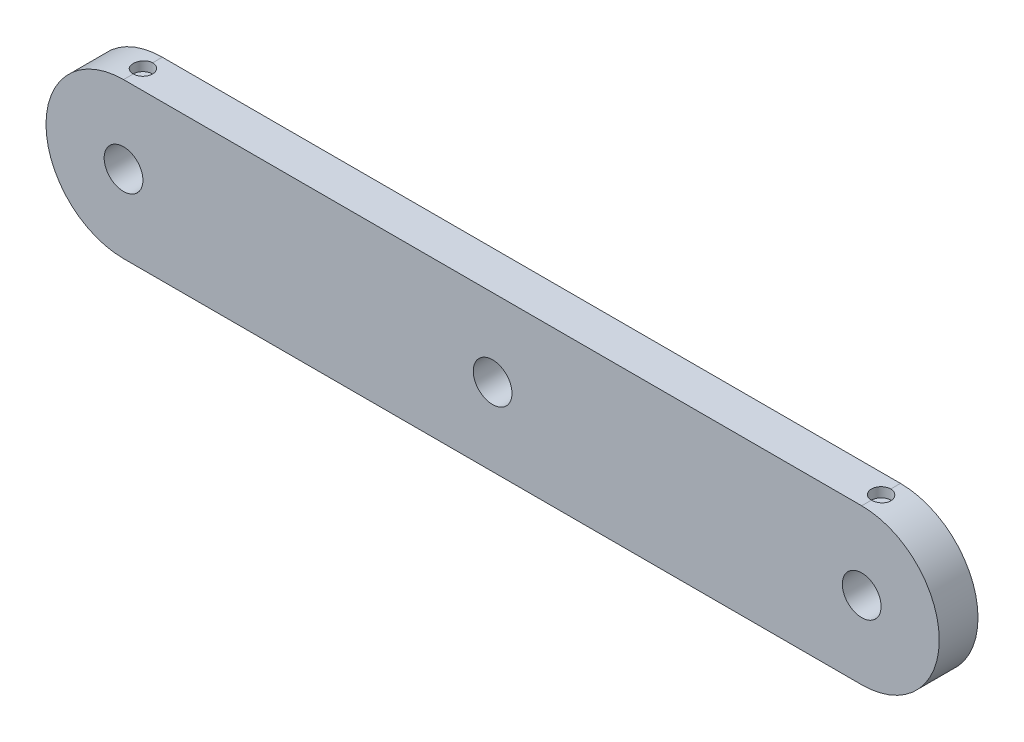
ISO-10303-21;
HEADER;
FILE_DESCRIPTION(('STEP AP214'),'2;1');
FILE_NAME('part.step','',(''),(''),'','','');
FILE_SCHEMA(('AUTOMOTIVE_DESIGN { 1 0 10303 214 1 1 1 1 }'));
ENDSEC;
DATA;
#1=APPLICATION_CONTEXT('core data for automotive mechanical design processes');
#2=APPLICATION_PROTOCOL_DEFINITION('international standard','automotive_design',2000,#1);
#3=PRODUCT_CONTEXT('',#1,'mechanical');
#4=PRODUCT('Part','Part','',(#3));
#5=PRODUCT_RELATED_PRODUCT_CATEGORY('part','',(#4));
#6=PRODUCT_DEFINITION_FORMATION('','',#4);
#7=PRODUCT_DEFINITION_CONTEXT('part definition',#1,'design');
#8=PRODUCT_DEFINITION('design','',#6,#7);
#9=PRODUCT_DEFINITION_SHAPE('','',#8);
#10=(LENGTH_UNIT() NAMED_UNIT(*) SI_UNIT(.MILLI.,.METRE.));
#11=(NAMED_UNIT(*) PLANE_ANGLE_UNIT() SI_UNIT($,.RADIAN.));
#12=(NAMED_UNIT(*) SI_UNIT($,.STERADIAN.) SOLID_ANGLE_UNIT());
#13=UNCERTAINTY_MEASURE_WITH_UNIT(LENGTH_MEASURE(1.E-05),#10,'distance_accuracy_value','');
#14=(GEOMETRIC_REPRESENTATION_CONTEXT(3) GLOBAL_UNCERTAINTY_ASSIGNED_CONTEXT((#13)) GLOBAL_UNIT_ASSIGNED_CONTEXT((#10,
#11,#12)) REPRESENTATION_CONTEXT('',''));
#15=CARTESIAN_POINT('',(0.,0.,0.));
#16=DIRECTION('',(0.,0.,1.));
#17=DIRECTION('',(1.,0.,0.));
#18=AXIS2_PLACEMENT_3D('',#15,#16,#17);
#19=CARTESIAN_POINT('',(-19.0419865714244,0.,2.));
#20=DIRECTION('',(0.,0.,1.));
#21=DIRECTION('',(1.,0.,0.));
#22=AXIS2_PLACEMENT_3D('',#19,#20,#21);
#23=PLANE('',#22);
#24=CARTESIAN_POINT('',(-19.0419865714244,0.,2.));
#25=DIRECTION('',(0.,0.,1.));
#26=DIRECTION('',(1.,0.,0.));
#27=AXIS2_PLACEMENT_3D('',#24,#25,#26);
#28=CIRCLE('',#27,0.999999999999943);
#29=CARTESIAN_POINT('',(-18.0419865714244,0.,2.));
#30=VERTEX_POINT('',#29);
#31=EDGE_CURVE('E134',#30,#30,#28,.T.);
#32=ORIENTED_EDGE('',*,*,#31,.F.);
#33=EDGE_LOOP('',(#32));
#34=FACE_BOUND('',#33,.T.);
#35=CARTESIAN_POINT('',(-19.0419865714244,0.,2.));
#36=DIRECTION('',(0.,0.,1.));
#37=DIRECTION('',(1.,0.,0.));
#38=AXIS2_PLACEMENT_3D('',#35,#36,#37);
#39=CIRCLE('',#38,3.99999999999989);
#40=CARTESIAN_POINT('',(-19.0419865714246,3.99999999999995,2.));
#41=VERTEX_POINT('',#40);
#42=CARTESIAN_POINT('',(-19.0419865714244,-3.99999999999984,2.));
#43=VERTEX_POINT('',#42);
#44=EDGE_CURVE('E115',#41,#43,#39,.T.);
#45=ORIENTED_EDGE('',*,*,#44,.T.);
#46=DIRECTION('',(1.,0.,0.));
#47=VECTOR('',#46,1.);
#48=CARTESIAN_POINT('',(-19.0419865714244,-3.99999999999984,2.));
#49=LINE('',#48,#47);
#50=CARTESIAN_POINT('',(19.0419865714246,-3.99999999999995,2.));
#51=VERTEX_POINT('',#50);
#52=EDGE_CURVE('E127',#43,#51,#49,.T.);
#53=ORIENTED_EDGE('',*,*,#52,.T.);
#54=CARTESIAN_POINT('',(19.0419865714246,0.,2.));
#55=DIRECTION('',(0.,0.,1.));
#56=DIRECTION('',(1.,0.,0.));
#57=AXIS2_PLACEMENT_3D('',#54,#55,#56);
#58=CIRCLE('',#57,3.99999999999989);
#59=CARTESIAN_POINT('',(19.0419865714246,3.99999999999995,2.));
#60=VERTEX_POINT('',#59);
#61=EDGE_CURVE('E125',#51,#60,#58,.T.);
#62=ORIENTED_EDGE('',*,*,#61,.T.);
#63=DIRECTION('',(-1.,0.,0.));
#64=VECTOR('',#63,1.);
#65=CARTESIAN_POINT('',(-19.0419865714246,3.99999999999995,2.));
#66=LINE('',#65,#64);
#67=EDGE_CURVE('E104',#60,#41,#66,.T.);
#68=ORIENTED_EDGE('',*,*,#67,.T.);
#69=EDGE_LOOP('',(#45,#53,#62,#68));
#70=FACE_BOUND('',#69,.T.);
#71=CARTESIAN_POINT('',(0.,0.,2.));
#72=DIRECTION('',(0.,0.,1.));
#73=DIRECTION('',(1.,0.,0.));
#74=AXIS2_PLACEMENT_3D('',#71,#72,#73);
#75=CIRCLE('',#74,1.00000000000007);
#76=CARTESIAN_POINT('',(1.00000000000007,0.,2.));
#77=VERTEX_POINT('',#76);
#78=EDGE_CURVE('E123',#77,#77,#75,.T.);
#79=ORIENTED_EDGE('',*,*,#78,.F.);
#80=EDGE_LOOP('',(#79));
#81=FACE_BOUND('',#80,.T.);
#82=CARTESIAN_POINT('',(19.0419865714246,0.,2.));
#83=DIRECTION('',(0.,0.,1.));
#84=DIRECTION('',(1.,0.,0.));
#85=AXIS2_PLACEMENT_3D('',#82,#83,#84);
#86=CIRCLE('',#85,1.00000000000007);
#87=CARTESIAN_POINT('',(20.0419865714247,0.,2.));
#88=VERTEX_POINT('',#87);
#89=EDGE_CURVE('E140',#88,#88,#86,.T.);
#90=ORIENTED_EDGE('',*,*,#89,.F.);
#91=EDGE_LOOP('',(#90));
#92=FACE_BOUND('',#91,.T.);
#93=ADVANCED_FACE('F33',(#34,#70,#81,#92),#23,.T.);
#94=CARTESIAN_POINT('',(-19.0419865714244,0.,0.));
#95=DIRECTION('',(0.,0.,1.));
#96=DIRECTION('',(1.,0.,0.));
#97=AXIS2_PLACEMENT_3D('',#94,#95,#96);
#98=PLANE('',#97);
#99=CARTESIAN_POINT('',(-19.0419865714244,0.,0.));
#100=DIRECTION('',(0.,0.,1.));
#101=DIRECTION('',(1.,0.,0.));
#102=AXIS2_PLACEMENT_3D('',#99,#100,#101);
#103=CIRCLE('',#102,0.999999999999943);
#104=CARTESIAN_POINT('',(-18.0419865714244,0.,0.));
#105=VERTEX_POINT('',#104);
#106=EDGE_CURVE('E137',#105,#105,#103,.T.);
#107=ORIENTED_EDGE('',*,*,#106,.T.);
#108=EDGE_LOOP('',(#107));
#109=FACE_BOUND('',#108,.T.);
#110=CARTESIAN_POINT('',(-19.0419865714244,0.,0.));
#111=DIRECTION('',(0.,0.,1.));
#112=DIRECTION('',(1.,0.,0.));
#113=AXIS2_PLACEMENT_3D('',#110,#111,#112);
#114=CIRCLE('',#113,3.99999999999989);
#115=CARTESIAN_POINT('',(-19.0419865714246,3.99999999999995,0.));
#116=VERTEX_POINT('',#115);
#117=CARTESIAN_POINT('',(-19.0419865714244,-3.99999999999984,0.));
#118=VERTEX_POINT('',#117);
#119=EDGE_CURVE('E120',#116,#118,#114,.T.);
#120=ORIENTED_EDGE('',*,*,#119,.F.);
#121=DIRECTION('',(-1.,0.,0.));
#122=VECTOR('',#121,1.);
#123=CARTESIAN_POINT('',(-19.0419865714246,3.99999999999995,0.));
#124=LINE('',#123,#122);
#125=CARTESIAN_POINT('',(19.0419865714246,3.99999999999995,0.));
#126=VERTEX_POINT('',#125);
#127=EDGE_CURVE('E112',#126,#116,#124,.T.);
#128=ORIENTED_EDGE('',*,*,#127,.F.);
#129=CARTESIAN_POINT('',(19.0419865714246,0.,0.));
#130=DIRECTION('',(0.,0.,1.));
#131=DIRECTION('',(1.,0.,0.));
#132=AXIS2_PLACEMENT_3D('',#129,#130,#131);
#133=CIRCLE('',#132,3.99999999999989);
#134=CARTESIAN_POINT('',(19.0419865714246,-3.99999999999995,0.));
#135=VERTEX_POINT('',#134);
#136=EDGE_CURVE('E116',#135,#126,#133,.T.);
#137=ORIENTED_EDGE('',*,*,#136,.F.);
#138=DIRECTION('',(1.,0.,0.));
#139=VECTOR('',#138,1.);
#140=CARTESIAN_POINT('',(-19.0419865714244,-3.99999999999984,0.));
#141=LINE('',#140,#139);
#142=EDGE_CURVE('E118',#118,#135,#141,.T.);
#143=ORIENTED_EDGE('',*,*,#142,.F.);
#144=EDGE_LOOP('',(#120,#128,#137,#143));
#145=FACE_BOUND('',#144,.T.);
#146=CARTESIAN_POINT('',(0.,0.,0.));
#147=DIRECTION('',(0.,0.,1.));
#148=DIRECTION('',(1.,0.,0.));
#149=AXIS2_PLACEMENT_3D('',#146,#147,#148);
#150=CIRCLE('',#149,1.00000000000007);
#151=CARTESIAN_POINT('',(1.00000000000007,0.,0.));
#152=VERTEX_POINT('',#151);
#153=EDGE_CURVE('E131',#152,#152,#150,.T.);
#154=ORIENTED_EDGE('',*,*,#153,.T.);
#155=EDGE_LOOP('',(#154));
#156=FACE_BOUND('',#155,.T.);
#157=CARTESIAN_POINT('',(19.0419865714246,0.,0.));
#158=DIRECTION('',(0.,0.,1.));
#159=DIRECTION('',(1.,0.,0.));
#160=AXIS2_PLACEMENT_3D('',#157,#158,#159);
#161=CIRCLE('',#160,1.00000000000007);
#162=CARTESIAN_POINT('',(20.0419865714247,0.,0.));
#163=VERTEX_POINT('',#162);
#164=EDGE_CURVE('E143',#163,#163,#161,.T.);
#165=ORIENTED_EDGE('',*,*,#164,.T.);
#166=EDGE_LOOP('',(#165));
#167=FACE_BOUND('',#166,.T.);
#168=ADVANCED_FACE('F177',(#109,#145,#156,#167),#98,.F.);
#169=CARTESIAN_POINT('',(-19.0419865714244,0.,2.));
#170=DIRECTION('',(0.,0.,-1.));
#171=DIRECTION('',(-1.,0.,0.));
#172=AXIS2_PLACEMENT_3D('',#169,#170,#171);
#173=CYLINDRICAL_SURFACE('',#172,3.99999999999989);
#174=DIRECTION('',(0.,0.,-1.));
#175=VECTOR('',#174,1.);
#176=CARTESIAN_POINT('',(-19.0419865714246,3.99999999999995,2.));
#177=LINE('',#176,#175);
#178=CARTESIAN_POINT('',(-19.0419865714246,3.99999999999995,1.5));
#179=VERTEX_POINT('',#178);
#180=EDGE_CURVE('E107',#41,#179,#177,.T.);
#181=ORIENTED_EDGE('',*,*,#180,.T.);
#182=CARTESIAN_POINT('',(-19.0419865714246,3.99999999999995,1.5));
#183=CARTESIAN_POINT('',(-19.0699998734899,4.00001123026525,1.50002440581871));
#184=CARTESIAN_POINT('',(-19.0980036185055,3.99970604622461,1.49764728285974));
#185=CARTESIAN_POINT('',(-19.1531862009609,3.99854617767852,1.48827289542741));
#186=CARTESIAN_POINT('',(-19.1803658762809,3.99769207235337,1.48128050043095));
#187=CARTESIAN_POINT('',(-19.2331655478784,3.99551700435899,1.46285473379586));
#188=CARTESIAN_POINT('',(-19.2587850250665,3.99419588729557,1.45141989335974));
#189=CARTESIAN_POINT('',(-19.3077400438985,3.99123732841575,1.42444747027317));
#190=CARTESIAN_POINT('',(-19.3310757686958,3.98959991199745,1.40891021700003));
#191=CARTESIAN_POINT('',(-19.3749280804125,3.98618079113776,1.37408264348786));
#192=CARTESIAN_POINT('',(-19.3954305473085,3.98439842970683,1.35477460670452));
#193=CARTESIAN_POINT('',(-19.4329153518104,3.98089561382974,1.31298972278445));
#194=CARTESIAN_POINT('',(-19.4498971468614,3.97917516895898,1.29051238813681));
#195=CARTESIAN_POINT('',(-19.4799090576034,3.97598456799428,1.24293530410356));
#196=CARTESIAN_POINT('',(-19.4929257663973,3.97451526827109,1.21782703514004));
#197=CARTESIAN_POINT('',(-19.5145516980932,3.97200219343723,1.16576098334992));
#198=CARTESIAN_POINT('',(-19.5231613493873,3.97095837696907,1.13880338057853));
#199=CARTESIAN_POINT('',(-19.5356862915746,3.96942068889684,1.08395149496283));
#200=CARTESIAN_POINT('',(-19.5396258189815,3.9689239789387,1.05606282729283));
#201=CARTESIAN_POINT('',(-19.5427737001535,3.96852805384939,1.00001543175915));
#202=CARTESIAN_POINT('',(-19.541982129521,3.96862882917048,0.971856708218097));
#203=CARTESIAN_POINT('',(-19.5357100104274,3.96941391186519,0.916238958358929));
#204=CARTESIAN_POINT('',(-19.5302562948609,3.97009487987534,0.88877685220304));
#205=CARTESIAN_POINT('',(-19.5148565931859,3.97195840572046,0.835160853734894));
#206=CARTESIAN_POINT('',(-19.5049105404861,3.97314097099076,0.809006980821387));
#207=CARTESIAN_POINT('',(-19.4807794306932,3.9758782615022,0.758665865594401));
#208=CARTESIAN_POINT('',(-19.4665826316928,3.97743401520964,0.734484309980567));
#209=CARTESIAN_POINT('',(-19.434362089603,3.98074149435642,0.688837755630672));
#210=CARTESIAN_POINT('',(-19.4163383331411,3.98249322048054,0.667372766387472));
#211=CARTESIAN_POINT('',(-19.3768293501971,3.98600997087511,0.62761436870434));
#212=CARTESIAN_POINT('',(-19.3553214596671,3.98777500470549,0.609343475917163));
#213=CARTESIAN_POINT('',(-19.3095250148149,3.99110876258182,0.576662560611256));
#214=CARTESIAN_POINT('',(-19.2852356392961,3.99267742836509,0.562253682517392));
#215=CARTESIAN_POINT('',(-19.234540894498,3.99544346494813,0.537704426238816));
#216=CARTESIAN_POINT('',(-19.2081335977972,3.99664049260012,0.527567989894497));
#217=CARTESIAN_POINT('',(-19.1540052779486,3.99852203511061,0.511898912154957));
#218=CARTESIAN_POINT('',(-19.1262862976615,3.99920732074057,0.506359345677845));
#219=CARTESIAN_POINT('',(-19.0796086998717,3.99986823220652,0.501058803856759));
#220=CARTESIAN_POINT('',(-19.0607932687395,4.000003833075,0.499990730311489));
#221=CARTESIAN_POINT('',(-19.0419865714246,3.99999999999995,0.500000000000001));
#222=B_SPLINE_CURVE_WITH_KNOTS('',3,(#182,#183,#184,#185,#186,#187,#188,#189,#190,#191,#192,
#193,#194,#195,#196,#197,#198,#199,#200,#201,#202,#203,#204,#205,#206,#207,#208,#209,#210,#211,
#212,#213,#214,#215,#216,#217,#218,#219,#220,#221),.UNSPECIFIED.,.F.,.F.,(4,2,2,2,2,2,2,2,2,2,2,
2,2,2,2,2,2,2,2,4),(0.,0.0839234479117966,0.167758491189171,0.251621276312826,0.335477330250437,
0.419737284805615,0.504010214648612,0.58856500676299,0.673111578088232,0.757217430472519,
0.841321938859883,0.924945619328749,1.00857053941938,1.09242862324256,1.17628700009416,
1.26071455726714,1.34516710513757,1.42969740096326,1.5141001214085,1.57051329024177),.UNSPECIFIED.);
#223=CARTESIAN_POINT('',(-19.0419865714246,3.99999999999995,0.500000000000001));
#224=VERTEX_POINT('',#223);
#225=EDGE_CURVE('E55',#179,#224,#222,.T.);
#226=ORIENTED_EDGE('',*,*,#225,.T.);
#227=EDGE_CURVE('E111',#224,#116,#177,.T.);
#228=ORIENTED_EDGE('',*,*,#227,.T.);
#229=ORIENTED_EDGE('',*,*,#119,.T.);
#230=DIRECTION('',(0.,0.,-1.));
#231=VECTOR('',#230,1.);
#232=CARTESIAN_POINT('',(-19.0419865714244,-3.99999999999984,2.));
#233=LINE('',#232,#231);
#234=EDGE_CURVE('E11',#43,#118,#233,.T.);
#235=ORIENTED_EDGE('',*,*,#234,.F.);
#236=ORIENTED_EDGE('',*,*,#44,.F.);
#237=EDGE_LOOP('',(#181,#226,#228,#229,#235,#236));
#238=FACE_BOUND('',#237,.T.);
#239=ADVANCED_FACE('F35',(#238),#173,.T.);
#240=CARTESIAN_POINT('',(-19.0419865714244,-3.99999999999984,2.));
#241=DIRECTION('',(0.,1.,0.));
#242=DIRECTION('',(0.,0.,1.));
#243=AXIS2_PLACEMENT_3D('',#240,#241,#242);
#244=PLANE('',#243);
#245=CARTESIAN_POINT('',(0.,-3.99999999999984,1.));
#246=DIRECTION('',(0.,-1.,0.));
#247=DIRECTION('',(0.,0.,-1.));
#248=AXIS2_PLACEMENT_3D('',#245,#246,#247);
#249=CIRCLE('',#248,0.5);
#250=CARTESIAN_POINT('',(0.,-3.99999999999984,0.5));
#251=VERTEX_POINT('',#250);
#252=EDGE_CURVE('E209',#251,#251,#249,.T.);
#253=ORIENTED_EDGE('',*,*,#252,.F.);
#254=EDGE_LOOP('',(#253));
#255=FACE_BOUND('',#254,.T.);
#256=ORIENTED_EDGE('',*,*,#142,.T.);
#257=DIRECTION('',(0.,0.,-1.));
#258=VECTOR('',#257,1.);
#259=CARTESIAN_POINT('',(19.0419865714246,-3.99999999999995,2.));
#260=LINE('',#259,#258);
#261=EDGE_CURVE('E42',#51,#135,#260,.T.);
#262=ORIENTED_EDGE('',*,*,#261,.F.);
#263=ORIENTED_EDGE('',*,*,#52,.F.);
#264=ORIENTED_EDGE('',*,*,#234,.T.);
#265=EDGE_LOOP('',(#256,#262,#263,#264));
#266=FACE_BOUND('',#265,.T.);
#267=ADVANCED_FACE('F186',(#255,#266),#244,.F.);
#268=CARTESIAN_POINT('',(19.0419865714246,0.,2.));
#269=DIRECTION('',(0.,0.,-1.));
#270=DIRECTION('',(-1.,0.,0.));
#271=AXIS2_PLACEMENT_3D('',#268,#269,#270);
#272=CYLINDRICAL_SURFACE('',#271,3.99999999999989);
#273=DIRECTION('',(0.,0.,-1.));
#274=VECTOR('',#273,1.);
#275=CARTESIAN_POINT('',(19.0419865714246,3.99999999999995,2.));
#276=LINE('',#275,#274);
#277=CARTESIAN_POINT('',(19.0419865714246,3.99999999999995,0.500000000000001));
#278=VERTEX_POINT('',#277);
#279=EDGE_CURVE('E99',#278,#126,#276,.T.);
#280=ORIENTED_EDGE('',*,*,#279,.F.);
#281=CARTESIAN_POINT('',(19.0419865714246,3.99999999999995,1.5));
#282=CARTESIAN_POINT('',(19.0140183523134,3.99999960979283,1.49999881181286));
#283=CARTESIAN_POINT('',(18.986032656564,3.99970356910968,1.49764542416614));
#284=CARTESIAN_POINT('',(18.9308400110066,3.99855108022252,1.48829444908584));
#285=CARTESIAN_POINT('',(18.9036339052998,3.99769404688268,1.48129201241532));
#286=CARTESIAN_POINT('',(18.850807456462,3.99551612208866,1.46285247121718));
#287=CARTESIAN_POINT('',(18.8251860593954,3.99419554291092,1.45141835163803));
#288=CARTESIAN_POINT('',(18.776230676446,3.99123740175603,1.42444654320604));
#289=CARTESIAN_POINT('',(18.7528962991133,3.98959989416807,1.40890955829386));
#290=CARTESIAN_POINT('',(18.7090440080383,3.98618064261249,1.37408161003208));
#291=CARTESIAN_POINT('',(18.6885404984372,3.98439822938467,1.35477257413075));
#292=CARTESIAN_POINT('',(18.6510560127131,3.98089545201934,1.31298743529267));
#293=CARTESIAN_POINT('',(18.6340752161461,3.97917509104837,1.29051117101735));
#294=CARTESIAN_POINT('',(18.6040645391678,3.97598461123901,1.24293600448687));
#295=CARTESIAN_POINT('',(18.5910481522364,3.97451535435566,1.21782852768641));
#296=CARTESIAN_POINT('',(18.5694219561096,3.9720022569152,1.16576258961053));
#297=CARTESIAN_POINT('',(18.5608119798115,3.97095840022611,1.1388041985706));
#298=CARTESIAN_POINT('',(18.5482867754196,3.96942067920706,1.08395116088265));
#299=CARTESIAN_POINT('',(18.5443472284782,3.96892396687333,1.05606214845917));
#300=CARTESIAN_POINT('',(18.5411994615131,3.96852805628542,1.00001474730564));
#301=CARTESIAN_POINT('',(18.5419910512241,3.96862883400285,0.971856369453747));
#302=CARTESIAN_POINT('',(18.548263124135,3.96941391073934,0.916239034550249));
#303=CARTESIAN_POINT('',(18.5537168188276,3.97009487592049,0.888777002759953));
#304=CARTESIAN_POINT('',(18.5691164947882,3.97195839951509,0.835160995756208));
#305=CARTESIAN_POINT('',(18.5790625670742,3.97314096809128,0.809007047057197));
#306=CARTESIAN_POINT('',(18.6031934594423,3.97587823172914,0.758666400195668));
#307=CARTESIAN_POINT('',(18.6173899206831,3.97743394642272,0.734485339950208));
#308=CARTESIAN_POINT('',(18.6496102775332,3.98074142286103,0.688838661117356));
#309=CARTESIAN_POINT('',(18.6676343482084,3.98249319357116,0.667373166805269));
#310=CARTESIAN_POINT('',(18.7071467492738,3.98601021978069,0.627611457855456));
#311=CARTESIAN_POINT('',(18.7286581698566,3.98777548477362,0.609338181646807));
#312=CARTESIAN_POINT('',(18.7744551376018,3.99110926511154,0.576658223993893));
#313=CARTESIAN_POINT('',(18.7987406911609,3.99267778000285,0.562251551465603));
#314=CARTESIAN_POINT('',(18.8494142371519,3.995442304437,0.53771373590722));
#315=CARTESIAN_POINT('',(18.875802932357,3.99663818880291,0.527584029223757));
#316=CARTESIAN_POINT('',(18.9299249833384,3.99852157155996,0.511905901295351));
#317=CARTESIAN_POINT('',(18.9576582760984,3.99920909375158,0.506357265572592));
#318=CARTESIAN_POINT('',(19.0134839386419,3.99999519282136,0.500028515147891));
#319=CARTESIAN_POINT('',(19.0415726733849,4.00009767228511,0.499216801527187));
#320=CARTESIAN_POINT('',(19.0974857787241,3.9997126760107,0.50230154681119));
#321=CARTESIAN_POINT('',(19.1253101549375,3.99922521283626,0.506197905450318));
#322=CARTESIAN_POINT('',(19.1798114729689,3.99771753751322,0.518561941754876));
#323=CARTESIAN_POINT('',(19.2064918855095,3.99669908162757,0.527014552680525));
#324=CARTESIAN_POINT('',(19.2580565023963,3.99424344620023,0.548235490382581));
#325=CARTESIAN_POINT('',(19.2829406457176,3.99280625244108,0.561003963698283));
#326=CARTESIAN_POINT('',(19.3303474755621,3.98966364582006,0.59057062750149));
#327=CARTESIAN_POINT('',(19.3528573234133,3.98795688808485,0.607389257961125));
#328=CARTESIAN_POINT('',(19.3947459693498,3.98447028465115,0.644549899506838));
#329=CARTESIAN_POINT('',(19.414124643092,3.98269043605363,0.664892050450196));
#330=CARTESIAN_POINT('',(19.4493129631882,3.97924621092501,0.708661483351426));
#331=CARTESIAN_POINT('',(19.4651016635382,3.97758254944249,0.732105669262076));
#332=CARTESIAN_POINT('',(19.4925171493133,3.97457082207413,0.781331648970939));
#333=CARTESIAN_POINT('',(19.5041440181703,3.97322274986189,0.8071133958953));
#334=CARTESIAN_POINT('',(19.5228718871979,3.97099970078583,0.860215063829519));
#335=CARTESIAN_POINT('',(19.529984696916,3.97012349036941,0.88753076600959));
#336=CARTESIAN_POINT('',(19.5395205701982,3.96893983181475,0.942980496756129));
#337=CARTESIAN_POINT('',(19.5419438519317,3.96863235721739,0.971114487191796));
#338=CARTESIAN_POINT('',(19.5420278786416,3.96862175396475,1.02719378584093));
#339=CARTESIAN_POINT('',(19.5397215309644,3.96891444950374,1.05513904966637));
#340=CARTESIAN_POINT('',(19.5304814523944,3.97006222907424,1.11024142586901));
#341=CARTESIAN_POINT('',(19.5235477210057,3.970917313166,1.13739853816175));
#342=CARTESIAN_POINT('',(19.5052599861625,3.97309223154894,1.19014939135327));
#343=CARTESIAN_POINT('',(19.4939075676188,3.9744118991854,1.21574368900436));
#344=CARTESIAN_POINT('',(19.4671079518546,3.97736756648947,1.26466933080966));
#345=CARTESIAN_POINT('',(19.4516607033265,3.97900357012066,1.28800064660396));
#346=CARTESIAN_POINT('',(19.4169878376778,3.9824212095043,1.33190624506809));
#347=CARTESIAN_POINT('',(19.3977376965796,3.9842037441679,1.35246109219099));
#348=CARTESIAN_POINT('',(19.3560566168183,3.98770566318564,1.39006136503359));
#349=CARTESIAN_POINT('',(19.3336249292529,3.98942503255102,1.40710596215486));
#350=CARTESIAN_POINT('',(19.2861196955954,3.99261411317333,1.43725707142106));
#351=CARTESIAN_POINT('',(19.2610364273438,3.99408285015644,1.45034836117985));
#352=CARTESIAN_POINT('',(19.2090231518848,3.99659529815329,1.47211424858325));
#353=CARTESIAN_POINT('',(19.1820951875986,3.997639470739,1.48079364527069));
#354=CARTESIAN_POINT('',(19.1361877258182,3.99893344065532,1.49141186763426));
#355=CARTESIAN_POINT('',(19.117497704128,3.99933145179072,1.49462778839641));
#356=CARTESIAN_POINT('',(19.0798699840671,3.99986486265824,1.49892224913864));
#357=CARTESIAN_POINT('',(19.0609322875238,4.00000026432687,1.50000080487986));
#358=CARTESIAN_POINT('',(19.0419865714246,3.99999999999995,1.5));
#359=B_SPLINE_CURVE_WITH_KNOTS('',3,(#281,#282,#283,#284,#285,#286,#287,#288,#289,#290,#291,
#292,#293,#294,#295,#296,#297,#298,#299,#300,#301,#302,#303,#304,#305,#306,#307,#308,#309,#310,
#311,#312,#313,#314,#315,#316,#317,#318,#319,#320,#321,#322,#323,#324,#325,#326,#327,#328,#329,
#330,#331,#332,#333,#334,#335,#336,#337,#338,#339,#340,#341,#342,#343,#344,#345,#346,#347,#348,
#349,#350,#351,#352,#353,#354,#355,#356,#357,#358),.UNSPECIFIED.,.T.,.F.,(4,2,2,2,2,2,2,2,2,2,2,
2,2,2,2,2,2,2,2,2,2,2,2,2,2,2,2,2,2,2,2,2,2,2,2,2,2,2,4),(0.,0.0838354545552498,
0.167758492188684,0.25162510163635,0.335477331182143,0.419741626403683,0.504010215600018,
0.588562500637734,0.673111578993608,0.757218450572636,0.841321939769322,0.924945392883377,
1.00857054033248,1.09242685257106,1.17628700102727,1.26072695627283,1.34516710622622,
1.4296355914632,1.51410012180756,1.59800055878383,1.68189920900385,1.76552210778678,
1.84914784615789,1.93320480585684,2.01726510275017,2.10180394301514,2.18634108844307,
2.27065614856184,2.35496728602124,2.43869380240442,2.52242032775909,2.60611684941297,
2.68981441982452,2.77407047538365,2.85834639694002,2.9429428060737,3.02744699736806,
3.08423768637525,3.14102795660087),.UNSPECIFIED.);
#360=CARTESIAN_POINT('',(19.0419865714246,3.99999999999995,1.5));
#361=VERTEX_POINT('',#360);
#362=EDGE_CURVE('E48',#278,#361,#359,.T.);
#363=ORIENTED_EDGE('',*,*,#362,.T.);
#364=EDGE_CURVE('E96',#60,#361,#276,.T.);
#365=ORIENTED_EDGE('',*,*,#364,.F.);
#366=ORIENTED_EDGE('',*,*,#61,.F.);
#367=ORIENTED_EDGE('',*,*,#261,.T.);
#368=ORIENTED_EDGE('',*,*,#136,.T.);
#369=EDGE_LOOP('',(#280,#363,#365,#366,#367,#368));
#370=FACE_BOUND('',#369,.T.);
#371=ADVANCED_FACE('F94',(#370),#272,.T.);
#372=CARTESIAN_POINT('',(-19.0419865714246,3.99999999999995,2.));
#373=DIRECTION('',(0.,-1.,0.));
#374=DIRECTION('',(0.,0.,-1.));
#375=AXIS2_PLACEMENT_3D('',#372,#373,#374);
#376=PLANE('',#375);
#377=ORIENTED_EDGE('',*,*,#364,.T.);
#378=CARTESIAN_POINT('',(19.0419865714246,3.99999999999995,1.));
#379=DIRECTION('',(0.,1.,0.));
#380=DIRECTION('',(0.,0.,-1.));
#381=AXIS2_PLACEMENT_3D('',#378,#379,#380);
#382=CIRCLE('',#381,0.499999999999999);
#383=EDGE_CURVE('E84',#278,#361,#382,.T.);
#384=ORIENTED_EDGE('',*,*,#383,.F.);
#385=ORIENTED_EDGE('',*,*,#279,.T.);
#386=ORIENTED_EDGE('',*,*,#127,.T.);
#387=ORIENTED_EDGE('',*,*,#227,.F.);
#388=CARTESIAN_POINT('',(-19.0419865714246,3.99999999999995,1.));
#389=DIRECTION('',(0.,1.,0.));
#390=DIRECTION('',(0.,0.,1.));
#391=AXIS2_PLACEMENT_3D('',#388,#389,#390);
#392=CIRCLE('',#391,0.499999999999999);
#393=EDGE_CURVE('E100',#179,#224,#392,.T.);
#394=ORIENTED_EDGE('',*,*,#393,.F.);
#395=ORIENTED_EDGE('',*,*,#180,.F.);
#396=ORIENTED_EDGE('',*,*,#67,.F.);
#397=EDGE_LOOP('',(#377,#384,#385,#386,#387,#394,#395,#396));
#398=FACE_BOUND('',#397,.T.);
#399=ADVANCED_FACE('F102',(#398),#376,.F.);
#400=CARTESIAN_POINT('',(0.,0.,2.));
#401=DIRECTION('',(0.,0.,-1.));
#402=DIRECTION('',(-1.,0.,0.));
#403=AXIS2_PLACEMENT_3D('',#400,#401,#402);
#404=CYLINDRICAL_SURFACE('',#403,1.00000000000007);
#405=ORIENTED_EDGE('',*,*,#78,.T.);
#406=EDGE_LOOP('',(#405));
#407=FACE_BOUND('',#406,.T.);
#408=ORIENTED_EDGE('',*,*,#153,.F.);
#409=EDGE_LOOP('',(#408));
#410=FACE_BOUND('',#409,.T.);
#411=ADVANCED_FACE('F170',(#407,#410),#404,.F.);
#412=CARTESIAN_POINT('',(-19.0419865714244,0.,2.));
#413=DIRECTION('',(0.,0.,-1.));
#414=DIRECTION('',(-1.,0.,0.));
#415=AXIS2_PLACEMENT_3D('',#412,#413,#414);
#416=CYLINDRICAL_SURFACE('',#415,0.999999999999943);
#417=ORIENTED_EDGE('',*,*,#31,.T.);
#418=EDGE_LOOP('',(#417));
#419=FACE_BOUND('',#418,.T.);
#420=ORIENTED_EDGE('',*,*,#106,.F.);
#421=EDGE_LOOP('',(#420));
#422=FACE_BOUND('',#421,.T.);
#423=ADVANCED_FACE('F166',(#419,#422),#416,.F.);
#424=CARTESIAN_POINT('',(19.0419865714246,0.,2.));
#425=DIRECTION('',(0.,0.,-1.));
#426=DIRECTION('',(-1.,0.,0.));
#427=AXIS2_PLACEMENT_3D('',#424,#425,#426);
#428=CYLINDRICAL_SURFACE('',#427,1.00000000000007);
#429=ORIENTED_EDGE('',*,*,#89,.T.);
#430=EDGE_LOOP('',(#429));
#431=FACE_BOUND('',#430,.T.);
#432=ORIENTED_EDGE('',*,*,#164,.F.);
#433=EDGE_LOOP('',(#432));
#434=FACE_BOUND('',#433,.T.);
#435=ADVANCED_FACE('F161',(#431,#434),#428,.F.);
#436=CARTESIAN_POINT('',(-19.0419865714246,3.49999999999995,1.));
#437=DIRECTION('',(0.,1.,0.));
#438=DIRECTION('',(0.,0.,1.));
#439=AXIS2_PLACEMENT_3D('',#436,#437,#438);
#440=CYLINDRICAL_SURFACE('',#439,0.499999999999999);
#441=CARTESIAN_POINT('',(-19.0419865714246,3.49999999999995,1.));
#442=DIRECTION('',(0.,1.,0.));
#443=DIRECTION('',(0.,0.,1.));
#444=AXIS2_PLACEMENT_3D('',#441,#442,#443);
#445=CIRCLE('',#444,0.499999999999999);
#446=CARTESIAN_POINT('',(-19.0419865714246,3.49999999999995,1.5));
#447=VERTEX_POINT('',#446);
#448=EDGE_CURVE('E153',#447,#447,#445,.T.);
#449=ORIENTED_EDGE('',*,*,#448,.F.);
#450=EDGE_LOOP('',(#449));
#451=FACE_BOUND('',#450,.T.);
#452=ORIENTED_EDGE('',*,*,#393,.T.);
#453=ORIENTED_EDGE('',*,*,#225,.F.);
#454=EDGE_LOOP('',(#452,#453));
#455=FACE_BOUND('',#454,.T.);
#456=ADVANCED_FACE('F155',(#451,#455),#440,.F.);
#457=CARTESIAN_POINT('',(-19.0419865714246,3.49999999999995,1.));
#458=DIRECTION('',(0.,1.,0.));
#459=DIRECTION('',(0.,0.,1.));
#460=AXIS2_PLACEMENT_3D('',#457,#458,#459);
#461=PLANE('',#460);
#462=ORIENTED_EDGE('',*,*,#448,.T.);
#463=EDGE_LOOP('',(#462));
#464=FACE_BOUND('',#463,.T.);
#465=ADVANCED_FACE('F160',(#464),#461,.T.);
#466=CARTESIAN_POINT('',(19.0419865714246,3.49999999999995,1.));
#467=DIRECTION('',(0.,1.,0.));
#468=DIRECTION('',(0.,0.,1.));
#469=AXIS2_PLACEMENT_3D('',#466,#467,#468);
#470=CYLINDRICAL_SURFACE('',#469,0.499999999999999);
#471=CARTESIAN_POINT('',(19.0419865714246,3.49999999999995,1.));
#472=DIRECTION('',(0.,1.,0.));
#473=DIRECTION('',(0.,0.,-1.));
#474=AXIS2_PLACEMENT_3D('',#471,#472,#473);
#475=CIRCLE('',#474,0.499999999999999);
#476=CARTESIAN_POINT('',(19.0419865714246,3.49999999999995,0.500000000000001));
#477=VERTEX_POINT('',#476);
#478=EDGE_CURVE('E89',#477,#477,#475,.T.);
#479=ORIENTED_EDGE('',*,*,#478,.F.);
#480=EDGE_LOOP('',(#479));
#481=FACE_BOUND('',#480,.T.);
#482=ORIENTED_EDGE('',*,*,#383,.T.);
#483=ORIENTED_EDGE('',*,*,#362,.F.);
#484=EDGE_LOOP('',(#482,#483));
#485=FACE_BOUND('',#484,.T.);
#486=ADVANCED_FACE('F85',(#481,#485),#470,.F.);
#487=CARTESIAN_POINT('',(19.0419865714246,3.49999999999995,1.));
#488=DIRECTION('',(0.,-1.,0.));
#489=DIRECTION('',(0.,0.,-1.));
#490=AXIS2_PLACEMENT_3D('',#487,#488,#489);
#491=PLANE('',#490);
#492=ORIENTED_EDGE('',*,*,#478,.T.);
#493=EDGE_LOOP('',(#492));
#494=FACE_BOUND('',#493,.T.);
#495=ADVANCED_FACE('F193',(#494),#491,.F.);
#496=CARTESIAN_POINT('',(0.,-3.49999999999984,1.));
#497=DIRECTION('',(0.,-1.,0.));
#498=DIRECTION('',(0.,0.,-1.));
#499=AXIS2_PLACEMENT_3D('',#496,#497,#498);
#500=CYLINDRICAL_SURFACE('',#499,0.5);
#501=CARTESIAN_POINT('',(0.,-3.49999999999984,1.));
#502=DIRECTION('',(0.,-1.,0.));
#503=DIRECTION('',(0.,0.,-1.));
#504=AXIS2_PLACEMENT_3D('',#501,#502,#503);
#505=CIRCLE('',#504,0.5);
#506=CARTESIAN_POINT('',(0.,-3.49999999999984,0.5));
#507=VERTEX_POINT('',#506);
#508=EDGE_CURVE('E90',#507,#507,#505,.T.);
#509=ORIENTED_EDGE('',*,*,#508,.F.);
#510=EDGE_LOOP('',(#509));
#511=FACE_BOUND('',#510,.T.);
#512=ORIENTED_EDGE('',*,*,#252,.T.);
#513=EDGE_LOOP('',(#512));
#514=FACE_BOUND('',#513,.T.);
#515=ADVANCED_FACE('F197',(#511,#514),#500,.F.);
#516=CARTESIAN_POINT('',(0.,-3.49999999999984,1.));
#517=DIRECTION('',(0.,-1.,0.));
#518=DIRECTION('',(0.,0.,-1.));
#519=AXIS2_PLACEMENT_3D('',#516,#517,#518);
#520=PLANE('',#519);
#521=ORIENTED_EDGE('',*,*,#508,.T.);
#522=EDGE_LOOP('',(#521));
#523=FACE_BOUND('',#522,.T.);
#524=ADVANCED_FACE('F201',(#523),#520,.T.);
#525=CLOSED_SHELL('',(#93,#168,#239,#267,#371,#399,#411,#423,#435,#456,#465,#486,#495,#515,#524));
#526=MANIFOLD_SOLID_BREP('B2',#525);
#527=ADVANCED_BREP_SHAPE_REPRESENTATION('',(#18,#526),#14);
#528=SHAPE_DEFINITION_REPRESENTATION(#9,#527);
ENDSEC;
END-ISO-10303-21;
